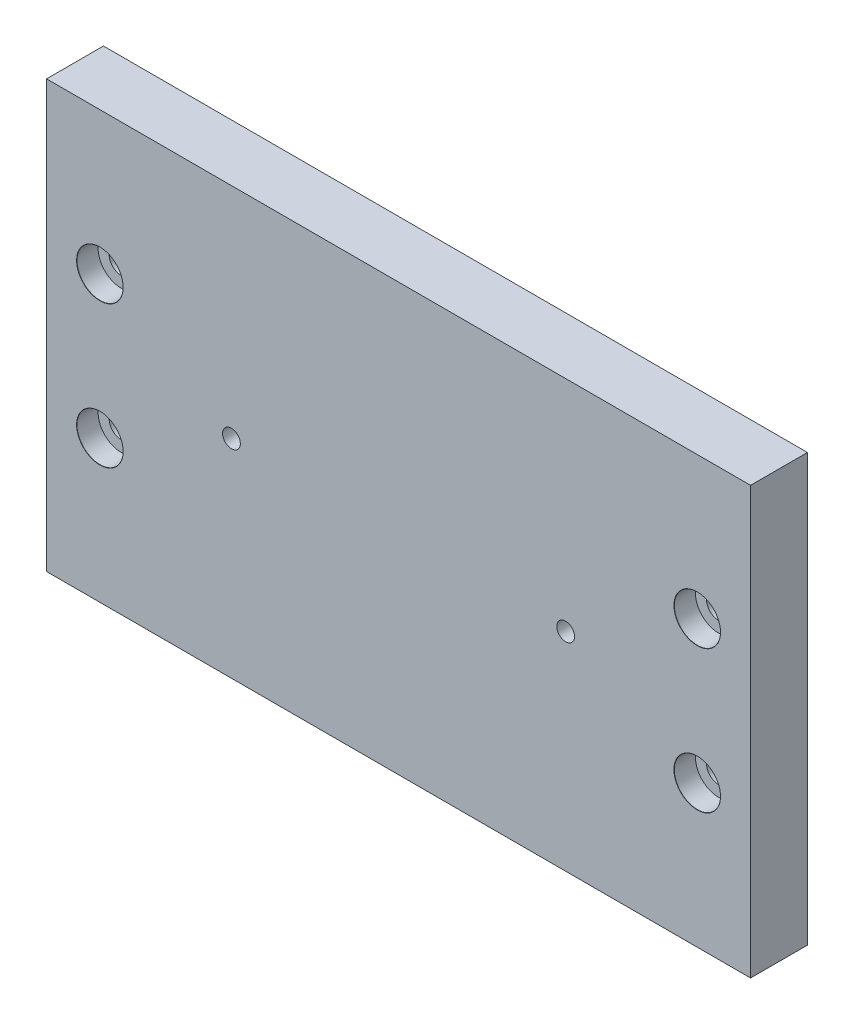
ISO-10303-21;
HEADER;
FILE_DESCRIPTION(('STEP AP214'),'2;1');
FILE_NAME('part.step','',(''),(''),'','','');
FILE_SCHEMA(('AUTOMOTIVE_DESIGN { 1 0 10303 214 1 1 1 1 }'));
ENDSEC;
DATA;
#1=APPLICATION_CONTEXT('core data for automotive mechanical design processes');
#2=APPLICATION_PROTOCOL_DEFINITION('international standard','automotive_design',2000,#1);
#3=PRODUCT_CONTEXT('',#1,'mechanical');
#4=PRODUCT('Part','Part','',(#3));
#5=PRODUCT_RELATED_PRODUCT_CATEGORY('part','',(#4));
#6=PRODUCT_DEFINITION_FORMATION('','',#4);
#7=PRODUCT_DEFINITION_CONTEXT('part definition',#1,'design');
#8=PRODUCT_DEFINITION('design','',#6,#7);
#9=PRODUCT_DEFINITION_SHAPE('','',#8);
#10=(LENGTH_UNIT() NAMED_UNIT(*) SI_UNIT(.MILLI.,.METRE.));
#11=(NAMED_UNIT(*) PLANE_ANGLE_UNIT() SI_UNIT($,.RADIAN.));
#12=(NAMED_UNIT(*) SI_UNIT($,.STERADIAN.) SOLID_ANGLE_UNIT());
#13=UNCERTAINTY_MEASURE_WITH_UNIT(LENGTH_MEASURE(1.E-05),#10,'distance_accuracy_value','');
#14=(GEOMETRIC_REPRESENTATION_CONTEXT(3) GLOBAL_UNCERTAINTY_ASSIGNED_CONTEXT((#13)) GLOBAL_UNIT_ASSIGNED_CONTEXT((#10,
#11,#12)) REPRESENTATION_CONTEXT('',''));
#15=CARTESIAN_POINT('',(0.,0.,0.));
#16=DIRECTION('',(0.,0.,1.));
#17=DIRECTION('',(1.,0.,0.));
#18=AXIS2_PLACEMENT_3D('',#15,#16,#17);
#19=CARTESIAN_POINT('',(49.5,-30.,4.));
#20=DIRECTION('',(-1.,0.,0.));
#21=DIRECTION('',(0.,0.,1.));
#22=AXIS2_PLACEMENT_3D('',#19,#20,#21);
#23=PLANE('',#22);
#24=DIRECTION('',(0.,1.,0.));
#25=VECTOR('',#24,1.);
#26=CARTESIAN_POINT('',(49.5,-30.,-4.));
#27=LINE('',#26,#25);
#28=CARTESIAN_POINT('',(49.5,-30.,-4.));
#29=VERTEX_POINT('',#28);
#30=CARTESIAN_POINT('',(49.5,30.,-4.));
#31=VERTEX_POINT('',#30);
#32=EDGE_CURVE('E100',#29,#31,#27,.T.);
#33=ORIENTED_EDGE('',*,*,#32,.T.);
#34=DIRECTION('',(0.,0.,-1.));
#35=VECTOR('',#34,1.);
#36=CARTESIAN_POINT('',(49.5,30.,4.));
#37=LINE('',#36,#35);
#38=CARTESIAN_POINT('',(49.5,30.,4.));
#39=VERTEX_POINT('',#38);
#40=EDGE_CURVE('E11',#39,#31,#37,.T.);
#41=ORIENTED_EDGE('',*,*,#40,.F.);
#42=DIRECTION('',(0.,1.,0.));
#43=VECTOR('',#42,1.);
#44=CARTESIAN_POINT('',(49.5,-30.,4.));
#45=LINE('',#44,#43);
#46=CARTESIAN_POINT('',(49.5,-30.,4.));
#47=VERTEX_POINT('',#46);
#48=EDGE_CURVE('E88',#47,#39,#45,.T.);
#49=ORIENTED_EDGE('',*,*,#48,.F.);
#50=DIRECTION('',(0.,0.,-1.));
#51=VECTOR('',#50,1.);
#52=CARTESIAN_POINT('',(49.5,-30.,4.));
#53=LINE('',#52,#51);
#54=EDGE_CURVE('E96',#47,#29,#53,.T.);
#55=ORIENTED_EDGE('',*,*,#54,.T.);
#56=EDGE_LOOP('',(#33,#41,#49,#55));
#57=FACE_BOUND('',#56,.T.);
#58=ADVANCED_FACE('F37',(#57),#23,.F.);
#59=CARTESIAN_POINT('',(-49.5,30.,4.));
#60=DIRECTION('',(0.,-1.,0.));
#61=DIRECTION('',(0.,0.,-1.));
#62=AXIS2_PLACEMENT_3D('',#59,#60,#61);
#63=PLANE('',#62);
#64=DIRECTION('',(-1.,0.,0.));
#65=VECTOR('',#64,1.);
#66=CARTESIAN_POINT('',(-49.5,30.,-4.));
#67=LINE('',#66,#65);
#68=CARTESIAN_POINT('',(-49.5,30.,-4.));
#69=VERTEX_POINT('',#68);
#70=EDGE_CURVE('E92',#31,#69,#67,.T.);
#71=ORIENTED_EDGE('',*,*,#70,.T.);
#72=DIRECTION('',(0.,0.,-1.));
#73=VECTOR('',#72,1.);
#74=CARTESIAN_POINT('',(-49.5,30.,4.));
#75=LINE('',#74,#73);
#76=CARTESIAN_POINT('',(-49.5,30.,4.));
#77=VERTEX_POINT('',#76);
#78=EDGE_CURVE('E45',#77,#69,#75,.T.);
#79=ORIENTED_EDGE('',*,*,#78,.F.);
#80=DIRECTION('',(-1.,0.,0.));
#81=VECTOR('',#80,1.);
#82=CARTESIAN_POINT('',(-49.5,30.,4.));
#83=LINE('',#82,#81);
#84=EDGE_CURVE('E83',#39,#77,#83,.T.);
#85=ORIENTED_EDGE('',*,*,#84,.F.);
#86=ORIENTED_EDGE('',*,*,#40,.T.);
#87=EDGE_LOOP('',(#71,#79,#85,#86));
#88=FACE_BOUND('',#87,.T.);
#89=ADVANCED_FACE('F91',(#88),#63,.F.);
#90=CARTESIAN_POINT('',(-49.5,-30.,4.));
#91=DIRECTION('',(1.,0.,0.));
#92=DIRECTION('',(0.,0.,-1.));
#93=AXIS2_PLACEMENT_3D('',#90,#91,#92);
#94=PLANE('',#93);
#95=DIRECTION('',(0.,-1.,0.));
#96=VECTOR('',#95,1.);
#97=CARTESIAN_POINT('',(-49.5,-30.,-4.));
#98=LINE('',#97,#96);
#99=CARTESIAN_POINT('',(-49.5,-30.,-4.));
#100=VERTEX_POINT('',#99);
#101=EDGE_CURVE('E70',#69,#100,#98,.T.);
#102=ORIENTED_EDGE('',*,*,#101,.T.);
#103=DIRECTION('',(0.,0.,-1.));
#104=VECTOR('',#103,1.);
#105=CARTESIAN_POINT('',(-49.5,-30.,4.));
#106=LINE('',#105,#104);
#107=CARTESIAN_POINT('',(-49.5,-30.,4.));
#108=VERTEX_POINT('',#107);
#109=EDGE_CURVE('E93',#108,#100,#106,.T.);
#110=ORIENTED_EDGE('',*,*,#109,.F.);
#111=DIRECTION('',(0.,-1.,0.));
#112=VECTOR('',#111,1.);
#113=CARTESIAN_POINT('',(-49.5,-30.,4.));
#114=LINE('',#113,#112);
#115=EDGE_CURVE('E86',#77,#108,#114,.T.);
#116=ORIENTED_EDGE('',*,*,#115,.F.);
#117=ORIENTED_EDGE('',*,*,#78,.T.);
#118=EDGE_LOOP('',(#102,#110,#116,#117));
#119=FACE_BOUND('',#118,.T.);
#120=ADVANCED_FACE('F94',(#119),#94,.F.);
#121=CARTESIAN_POINT('',(-49.5,-30.,4.));
#122=DIRECTION('',(0.,1.,0.));
#123=DIRECTION('',(0.,0.,1.));
#124=AXIS2_PLACEMENT_3D('',#121,#122,#123);
#125=PLANE('',#124);
#126=DIRECTION('',(1.,0.,0.));
#127=VECTOR('',#126,1.);
#128=CARTESIAN_POINT('',(-49.5,-30.,-4.));
#129=LINE('',#128,#127);
#130=EDGE_CURVE('E76',#100,#29,#129,.T.);
#131=ORIENTED_EDGE('',*,*,#130,.T.);
#132=ORIENTED_EDGE('',*,*,#54,.F.);
#133=DIRECTION('',(1.,0.,0.));
#134=VECTOR('',#133,1.);
#135=CARTESIAN_POINT('',(-49.5,-30.,4.));
#136=LINE('',#135,#134);
#137=EDGE_CURVE('E53',#108,#47,#136,.T.);
#138=ORIENTED_EDGE('',*,*,#137,.F.);
#139=ORIENTED_EDGE('',*,*,#109,.T.);
#140=EDGE_LOOP('',(#131,#132,#138,#139));
#141=FACE_BOUND('',#140,.T.);
#142=ADVANCED_FACE('F108',(#141),#125,.F.);
#143=CARTESIAN_POINT('',(0.,0.,4.));
#144=DIRECTION('',(0.,0.,-1.));
#145=DIRECTION('',(-1.,0.,0.));
#146=AXIS2_PLACEMENT_3D('',#143,#144,#145);
#147=PLANE('',#146);
#148=CARTESIAN_POINT('',(23.5,-0.800000000000002,4.));
#149=DIRECTION('',(0.,0.,1.));
#150=DIRECTION('',(1.,0.,0.));
#151=AXIS2_PLACEMENT_3D('',#148,#149,#150);
#152=CIRCLE('',#151,1.24999999999999);
#153=CARTESIAN_POINT('',(24.75,-0.800000000000002,4.));
#154=VERTEX_POINT('',#153);
#155=EDGE_CURVE('E194',#154,#154,#152,.T.);
#156=ORIENTED_EDGE('',*,*,#155,.F.);
#157=EDGE_LOOP('',(#156));
#158=FACE_BOUND('',#157,.T.);
#159=CARTESIAN_POINT('',(42.,10.,4.));
#160=DIRECTION('',(0.,0.,1.));
#161=DIRECTION('',(1.,0.,0.));
#162=AXIS2_PLACEMENT_3D('',#159,#160,#161);
#163=CIRCLE('',#162,3.275);
#164=CARTESIAN_POINT('',(45.275,10.,4.));
#165=VERTEX_POINT('',#164);
#166=EDGE_CURVE('E185',#165,#165,#163,.T.);
#167=ORIENTED_EDGE('',*,*,#166,.F.);
#168=EDGE_LOOP('',(#167));
#169=FACE_BOUND('',#168,.T.);
#170=CARTESIAN_POINT('',(42.,-10.,4.));
#171=DIRECTION('',(0.,0.,1.));
#172=DIRECTION('',(1.,0.,0.));
#173=AXIS2_PLACEMENT_3D('',#170,#171,#172);
#174=CIRCLE('',#173,3.275);
#175=CARTESIAN_POINT('',(45.275,-10.,4.));
#176=VERTEX_POINT('',#175);
#177=EDGE_CURVE('E167',#176,#176,#174,.T.);
#178=ORIENTED_EDGE('',*,*,#177,.F.);
#179=EDGE_LOOP('',(#178));
#180=FACE_BOUND('',#179,.T.);
#181=CARTESIAN_POINT('',(-23.5,-0.800000000000002,4.));
#182=DIRECTION('',(0.,0.,1.));
#183=DIRECTION('',(1.,0.,0.));
#184=AXIS2_PLACEMENT_3D('',#181,#182,#183);
#185=CIRCLE('',#184,1.24999999999999);
#186=CARTESIAN_POINT('',(-22.25,-0.800000000000002,4.));
#187=VERTEX_POINT('',#186);
#188=EDGE_CURVE('E152',#187,#187,#185,.T.);
#189=ORIENTED_EDGE('',*,*,#188,.F.);
#190=EDGE_LOOP('',(#189));
#191=FACE_BOUND('',#190,.T.);
#192=CARTESIAN_POINT('',(-42.,10.,4.));
#193=DIRECTION('',(0.,0.,1.));
#194=DIRECTION('',(1.,0.,0.));
#195=AXIS2_PLACEMENT_3D('',#192,#193,#194);
#196=CIRCLE('',#195,3.275);
#197=CARTESIAN_POINT('',(-38.725,10.,4.));
#198=VERTEX_POINT('',#197);
#199=EDGE_CURVE('E143',#198,#198,#196,.T.);
#200=ORIENTED_EDGE('',*,*,#199,.F.);
#201=EDGE_LOOP('',(#200));
#202=FACE_BOUND('',#201,.T.);
#203=CARTESIAN_POINT('',(-42.,-10.,4.));
#204=DIRECTION('',(0.,0.,1.));
#205=DIRECTION('',(1.,0.,0.));
#206=AXIS2_PLACEMENT_3D('',#203,#204,#205);
#207=CIRCLE('',#206,3.275);
#208=CARTESIAN_POINT('',(-38.725,-10.,4.));
#209=VERTEX_POINT('',#208);
#210=EDGE_CURVE('E125',#209,#209,#207,.T.);
#211=ORIENTED_EDGE('',*,*,#210,.F.);
#212=EDGE_LOOP('',(#211));
#213=FACE_BOUND('',#212,.T.);
#214=ORIENTED_EDGE('',*,*,#48,.T.);
#215=ORIENTED_EDGE('',*,*,#84,.T.);
#216=ORIENTED_EDGE('',*,*,#115,.T.);
#217=ORIENTED_EDGE('',*,*,#137,.T.);
#218=EDGE_LOOP('',(#214,#215,#216,#217));
#219=FACE_BOUND('',#218,.T.);
#220=ADVANCED_FACE('F84',(#158,#169,#180,#191,#202,#213,#219),#147,.F.);
#221=CARTESIAN_POINT('',(0.,0.,-4.));
#222=DIRECTION('',(0.,0.,-1.));
#223=DIRECTION('',(-1.,0.,0.));
#224=AXIS2_PLACEMENT_3D('',#221,#222,#223);
#225=PLANE('',#224);
#226=CARTESIAN_POINT('',(23.5,-0.800000000000002,-4.));
#227=DIRECTION('',(0.,0.,1.));
#228=DIRECTION('',(1.,0.,0.));
#229=AXIS2_PLACEMENT_3D('',#226,#227,#228);
#230=CIRCLE('',#229,1.25);
#231=CARTESIAN_POINT('',(24.75,-0.800000000000002,-4.));
#232=VERTEX_POINT('',#231);
#233=EDGE_CURVE('E191',#232,#232,#230,.T.);
#234=ORIENTED_EDGE('',*,*,#233,.T.);
#235=EDGE_LOOP('',(#234));
#236=FACE_BOUND('',#235,.T.);
#237=CARTESIAN_POINT('',(42.,10.,-4.));
#238=DIRECTION('',(0.,0.,1.));
#239=DIRECTION('',(1.,0.,0.));
#240=AXIS2_PLACEMENT_3D('',#237,#238,#239);
#241=CIRCLE('',#240,1.725);
#242=CARTESIAN_POINT('',(43.725,10.,-4.));
#243=VERTEX_POINT('',#242);
#244=EDGE_CURVE('E188',#243,#243,#241,.T.);
#245=ORIENTED_EDGE('',*,*,#244,.T.);
#246=EDGE_LOOP('',(#245));
#247=FACE_BOUND('',#246,.T.);
#248=CARTESIAN_POINT('',(42.,-10.,-4.));
#249=DIRECTION('',(0.,0.,1.));
#250=DIRECTION('',(1.,0.,0.));
#251=AXIS2_PLACEMENT_3D('',#248,#249,#250);
#252=CIRCLE('',#251,1.725);
#253=CARTESIAN_POINT('',(43.725,-10.,-4.));
#254=VERTEX_POINT('',#253);
#255=EDGE_CURVE('E170',#254,#254,#252,.T.);
#256=ORIENTED_EDGE('',*,*,#255,.T.);
#257=EDGE_LOOP('',(#256));
#258=FACE_BOUND('',#257,.T.);
#259=CARTESIAN_POINT('',(-23.5,-0.800000000000002,-4.));
#260=DIRECTION('',(0.,0.,1.));
#261=DIRECTION('',(1.,0.,0.));
#262=AXIS2_PLACEMENT_3D('',#259,#260,#261);
#263=CIRCLE('',#262,1.25);
#264=CARTESIAN_POINT('',(-22.25,-0.800000000000002,-4.));
#265=VERTEX_POINT('',#264);
#266=EDGE_CURVE('E149',#265,#265,#263,.T.);
#267=ORIENTED_EDGE('',*,*,#266,.T.);
#268=EDGE_LOOP('',(#267));
#269=FACE_BOUND('',#268,.T.);
#270=CARTESIAN_POINT('',(-42.,10.,-4.));
#271=DIRECTION('',(0.,0.,1.));
#272=DIRECTION('',(1.,0.,0.));
#273=AXIS2_PLACEMENT_3D('',#270,#271,#272);
#274=CIRCLE('',#273,1.725);
#275=CARTESIAN_POINT('',(-40.275,10.,-4.));
#276=VERTEX_POINT('',#275);
#277=EDGE_CURVE('E146',#276,#276,#274,.T.);
#278=ORIENTED_EDGE('',*,*,#277,.T.);
#279=EDGE_LOOP('',(#278));
#280=FACE_BOUND('',#279,.T.);
#281=CARTESIAN_POINT('',(-42.,-10.,-4.));
#282=DIRECTION('',(0.,0.,1.));
#283=DIRECTION('',(1.,0.,0.));
#284=AXIS2_PLACEMENT_3D('',#281,#282,#283);
#285=CIRCLE('',#284,1.725);
#286=CARTESIAN_POINT('',(-40.275,-10.,-4.));
#287=VERTEX_POINT('',#286);
#288=EDGE_CURVE('E128',#287,#287,#285,.T.);
#289=ORIENTED_EDGE('',*,*,#288,.T.);
#290=EDGE_LOOP('',(#289));
#291=FACE_BOUND('',#290,.T.);
#292=ORIENTED_EDGE('',*,*,#32,.F.);
#293=ORIENTED_EDGE('',*,*,#130,.F.);
#294=ORIENTED_EDGE('',*,*,#101,.F.);
#295=ORIENTED_EDGE('',*,*,#70,.F.);
#296=EDGE_LOOP('',(#292,#293,#294,#295));
#297=FACE_BOUND('',#296,.T.);
#298=ADVANCED_FACE('F111',(#236,#247,#258,#269,#280,#291,#297),#225,.T.);
#299=CARTESIAN_POINT('',(-42.,-10.,-3.975));
#300=DIRECTION('',(0.,0.,-1.));
#301=DIRECTION('',(-1.,0.,0.));
#302=AXIS2_PLACEMENT_3D('',#299,#300,#301);
#303=CONICAL_SURFACE('',#302,1.7,0.785398163397379);
#304=ORIENTED_EDGE('',*,*,#288,.F.);
#305=EDGE_LOOP('',(#304));
#306=FACE_BOUND('',#305,.T.);
#307=CARTESIAN_POINT('',(-42.,-10.,-3.975));
#308=DIRECTION('',(0.,0.,1.));
#309=DIRECTION('',(1.,0.,0.));
#310=AXIS2_PLACEMENT_3D('',#307,#308,#309);
#311=CIRCLE('',#310,1.7);
#312=CARTESIAN_POINT('',(-40.3,-10.,-3.975));
#313=VERTEX_POINT('',#312);
#314=EDGE_CURVE('E103',#313,#313,#311,.T.);
#315=ORIENTED_EDGE('',*,*,#314,.T.);
#316=EDGE_LOOP('',(#315));
#317=FACE_BOUND('',#316,.T.);
#318=ADVANCED_FACE('F242',(#306,#317),#303,.F.);
#319=CARTESIAN_POINT('',(-42.,-10.,4.));
#320=DIRECTION('',(0.,0.,1.));
#321=DIRECTION('',(1.,0.,0.));
#322=AXIS2_PLACEMENT_3D('',#319,#320,#321);
#323=CYLINDRICAL_SURFACE('',#322,1.7);
#324=ORIENTED_EDGE('',*,*,#314,.F.);
#325=EDGE_LOOP('',(#324));
#326=FACE_BOUND('',#325,.T.);
#327=CARTESIAN_POINT('',(-42.,-10.,1.));
#328=DIRECTION('',(0.,0.,1.));
#329=DIRECTION('',(1.,0.,0.));
#330=AXIS2_PLACEMENT_3D('',#327,#328,#329);
#331=CIRCLE('',#330,1.7);
#332=CARTESIAN_POINT('',(-40.3,-10.,1.));
#333=VERTEX_POINT('',#332);
#334=EDGE_CURVE('E116',#333,#333,#331,.T.);
#335=ORIENTED_EDGE('',*,*,#334,.T.);
#336=EDGE_LOOP('',(#335));
#337=FACE_BOUND('',#336,.T.);
#338=ADVANCED_FACE('F247',(#326,#337),#323,.F.);
#339=CARTESIAN_POINT('',(-38.75,-10.,1.));
#340=DIRECTION('',(0.,0.,-1.));
#341=DIRECTION('',(-1.,0.,0.));
#342=AXIS2_PLACEMENT_3D('',#339,#340,#341);
#343=PLANE('',#342);
#344=ORIENTED_EDGE('',*,*,#334,.F.);
#345=EDGE_LOOP('',(#344));
#346=FACE_BOUND('',#345,.T.);
#347=CARTESIAN_POINT('',(-42.,-10.,1.));
#348=DIRECTION('',(0.,0.,1.));
#349=DIRECTION('',(1.,0.,0.));
#350=AXIS2_PLACEMENT_3D('',#347,#348,#349);
#351=CIRCLE('',#350,3.25);
#352=CARTESIAN_POINT('',(-38.75,-10.,1.));
#353=VERTEX_POINT('',#352);
#354=EDGE_CURVE('E119',#353,#353,#351,.T.);
#355=ORIENTED_EDGE('',*,*,#354,.T.);
#356=EDGE_LOOP('',(#355));
#357=FACE_BOUND('',#356,.T.);
#358=ADVANCED_FACE('F226',(#346,#357),#343,.F.);
#359=CARTESIAN_POINT('',(-42.,-10.,4.));
#360=DIRECTION('',(0.,0.,1.));
#361=DIRECTION('',(1.,0.,0.));
#362=AXIS2_PLACEMENT_3D('',#359,#360,#361);
#363=CYLINDRICAL_SURFACE('',#362,3.25);
#364=ORIENTED_EDGE('',*,*,#354,.F.);
#365=EDGE_LOOP('',(#364));
#366=FACE_BOUND('',#365,.T.);
#367=CARTESIAN_POINT('',(-42.,-10.,3.975));
#368=DIRECTION('',(0.,0.,1.));
#369=DIRECTION('',(1.,0.,0.));
#370=AXIS2_PLACEMENT_3D('',#367,#368,#369);
#371=CIRCLE('',#370,3.25);
#372=CARTESIAN_POINT('',(-38.75,-10.,3.975));
#373=VERTEX_POINT('',#372);
#374=EDGE_CURVE('E122',#373,#373,#371,.T.);
#375=ORIENTED_EDGE('',*,*,#374,.T.);
#376=EDGE_LOOP('',(#375));
#377=FACE_BOUND('',#376,.T.);
#378=ADVANCED_FACE('F216',(#366,#377),#363,.F.);
#379=CARTESIAN_POINT('',(-42.,-10.,4.));
#380=DIRECTION('',(0.,0.,1.));
#381=DIRECTION('',(1.,0.,0.));
#382=AXIS2_PLACEMENT_3D('',#379,#380,#381);
#383=CONICAL_SURFACE('',#382,3.275,0.785398163397396);
#384=ORIENTED_EDGE('',*,*,#374,.F.);
#385=EDGE_LOOP('',(#384));
#386=FACE_BOUND('',#385,.T.);
#387=ORIENTED_EDGE('',*,*,#210,.T.);
#388=EDGE_LOOP('',(#387));
#389=FACE_BOUND('',#388,.T.);
#390=ADVANCED_FACE('F213',(#386,#389),#383,.F.);
#391=CARTESIAN_POINT('',(-42.,10.,-3.975));
#392=DIRECTION('',(0.,0.,-1.));
#393=DIRECTION('',(-1.,0.,0.));
#394=AXIS2_PLACEMENT_3D('',#391,#392,#393);
#395=CONICAL_SURFACE('',#394,1.7,0.785398163397379);
#396=ORIENTED_EDGE('',*,*,#277,.F.);
#397=EDGE_LOOP('',(#396));
#398=FACE_BOUND('',#397,.T.);
#399=CARTESIAN_POINT('',(-42.,10.,-3.975));
#400=DIRECTION('',(0.,0.,1.));
#401=DIRECTION('',(1.,0.,0.));
#402=AXIS2_PLACEMENT_3D('',#399,#400,#401);
#403=CIRCLE('',#402,1.7);
#404=CARTESIAN_POINT('',(-40.3,10.,-3.975));
#405=VERTEX_POINT('',#404);
#406=EDGE_CURVE('E131',#405,#405,#403,.T.);
#407=ORIENTED_EDGE('',*,*,#406,.T.);
#408=EDGE_LOOP('',(#407));
#409=FACE_BOUND('',#408,.T.);
#410=ADVANCED_FACE('F215',(#398,#409),#395,.F.);
#411=CARTESIAN_POINT('',(-42.,10.,4.));
#412=DIRECTION('',(0.,0.,1.));
#413=DIRECTION('',(1.,0.,0.));
#414=AXIS2_PLACEMENT_3D('',#411,#412,#413);
#415=CYLINDRICAL_SURFACE('',#414,1.7);
#416=ORIENTED_EDGE('',*,*,#406,.F.);
#417=EDGE_LOOP('',(#416));
#418=FACE_BOUND('',#417,.T.);
#419=CARTESIAN_POINT('',(-42.,10.,1.));
#420=DIRECTION('',(0.,0.,1.));
#421=DIRECTION('',(1.,0.,0.));
#422=AXIS2_PLACEMENT_3D('',#419,#420,#421);
#423=CIRCLE('',#422,1.7);
#424=CARTESIAN_POINT('',(-40.3,10.,1.));
#425=VERTEX_POINT('',#424);
#426=EDGE_CURVE('E134',#425,#425,#423,.T.);
#427=ORIENTED_EDGE('',*,*,#426,.T.);
#428=EDGE_LOOP('',(#427));
#429=FACE_BOUND('',#428,.T.);
#430=ADVANCED_FACE('F223',(#418,#429),#415,.F.);
#431=CARTESIAN_POINT('',(-38.75,10.,1.));
#432=DIRECTION('',(0.,0.,-1.));
#433=DIRECTION('',(-1.,0.,0.));
#434=AXIS2_PLACEMENT_3D('',#431,#432,#433);
#435=PLANE('',#434);
#436=ORIENTED_EDGE('',*,*,#426,.F.);
#437=EDGE_LOOP('',(#436));
#438=FACE_BOUND('',#437,.T.);
#439=CARTESIAN_POINT('',(-42.,10.,1.));
#440=DIRECTION('',(0.,0.,1.));
#441=DIRECTION('',(1.,0.,0.));
#442=AXIS2_PLACEMENT_3D('',#439,#440,#441);
#443=CIRCLE('',#442,3.25);
#444=CARTESIAN_POINT('',(-38.75,10.,1.));
#445=VERTEX_POINT('',#444);
#446=EDGE_CURVE('E137',#445,#445,#443,.T.);
#447=ORIENTED_EDGE('',*,*,#446,.T.);
#448=EDGE_LOOP('',(#447));
#449=FACE_BOUND('',#448,.T.);
#450=ADVANCED_FACE('F286',(#438,#449),#435,.F.);
#451=CARTESIAN_POINT('',(-42.,10.,4.));
#452=DIRECTION('',(0.,0.,1.));
#453=DIRECTION('',(1.,0.,0.));
#454=AXIS2_PLACEMENT_3D('',#451,#452,#453);
#455=CYLINDRICAL_SURFACE('',#454,3.25);
#456=ORIENTED_EDGE('',*,*,#446,.F.);
#457=EDGE_LOOP('',(#456));
#458=FACE_BOUND('',#457,.T.);
#459=CARTESIAN_POINT('',(-42.,10.,3.975));
#460=DIRECTION('',(0.,0.,1.));
#461=DIRECTION('',(1.,0.,0.));
#462=AXIS2_PLACEMENT_3D('',#459,#460,#461);
#463=CIRCLE('',#462,3.25);
#464=CARTESIAN_POINT('',(-38.75,10.,3.975));
#465=VERTEX_POINT('',#464);
#466=EDGE_CURVE('E140',#465,#465,#463,.T.);
#467=ORIENTED_EDGE('',*,*,#466,.T.);
#468=EDGE_LOOP('',(#467));
#469=FACE_BOUND('',#468,.T.);
#470=ADVANCED_FACE('F296',(#458,#469),#455,.F.);
#471=CARTESIAN_POINT('',(-42.,10.,4.));
#472=DIRECTION('',(0.,0.,1.));
#473=DIRECTION('',(1.,0.,0.));
#474=AXIS2_PLACEMENT_3D('',#471,#472,#473);
#475=CONICAL_SURFACE('',#474,3.275,0.785398163397396);
#476=ORIENTED_EDGE('',*,*,#466,.F.);
#477=EDGE_LOOP('',(#476));
#478=FACE_BOUND('',#477,.T.);
#479=ORIENTED_EDGE('',*,*,#199,.T.);
#480=EDGE_LOOP('',(#479));
#481=FACE_BOUND('',#480,.T.);
#482=ADVANCED_FACE('F306',(#478,#481),#475,.F.);
#483=CARTESIAN_POINT('',(-23.5,-0.800000000000002,4.));
#484=DIRECTION('',(0.,0.,1.));
#485=DIRECTION('',(1.,0.,0.));
#486=AXIS2_PLACEMENT_3D('',#483,#484,#485);
#487=CYLINDRICAL_SURFACE('',#486,1.24999999999999);
#488=ORIENTED_EDGE('',*,*,#266,.F.);
#489=EDGE_LOOP('',(#488));
#490=FACE_BOUND('',#489,.T.);
#491=ORIENTED_EDGE('',*,*,#188,.T.);
#492=EDGE_LOOP('',(#491));
#493=FACE_BOUND('',#492,.T.);
#494=ADVANCED_FACE('F316',(#490,#493),#487,.F.);
#495=CARTESIAN_POINT('',(42.,-10.,-3.975));
#496=DIRECTION('',(0.,0.,-1.));
#497=DIRECTION('',(-1.,0.,0.));
#498=AXIS2_PLACEMENT_3D('',#495,#496,#497);
#499=CONICAL_SURFACE('',#498,1.7,0.785398163397379);
#500=ORIENTED_EDGE('',*,*,#255,.F.);
#501=EDGE_LOOP('',(#500));
#502=FACE_BOUND('',#501,.T.);
#503=CARTESIAN_POINT('',(42.,-10.,-3.975));
#504=DIRECTION('',(0.,0.,1.));
#505=DIRECTION('',(1.,0.,0.));
#506=AXIS2_PLACEMENT_3D('',#503,#504,#505);
#507=CIRCLE('',#506,1.7);
#508=CARTESIAN_POINT('',(43.7,-10.,-3.975));
#509=VERTEX_POINT('',#508);
#510=EDGE_CURVE('E155',#509,#509,#507,.T.);
#511=ORIENTED_EDGE('',*,*,#510,.T.);
#512=EDGE_LOOP('',(#511));
#513=FACE_BOUND('',#512,.T.);
#514=ADVANCED_FACE('F327',(#502,#513),#499,.F.);
#515=CARTESIAN_POINT('',(42.,-10.,4.));
#516=DIRECTION('',(0.,0.,1.));
#517=DIRECTION('',(1.,0.,0.));
#518=AXIS2_PLACEMENT_3D('',#515,#516,#517);
#519=CYLINDRICAL_SURFACE('',#518,1.7);
#520=ORIENTED_EDGE('',*,*,#510,.F.);
#521=EDGE_LOOP('',(#520));
#522=FACE_BOUND('',#521,.T.);
#523=CARTESIAN_POINT('',(42.,-10.,1.));
#524=DIRECTION('',(0.,0.,1.));
#525=DIRECTION('',(1.,0.,0.));
#526=AXIS2_PLACEMENT_3D('',#523,#524,#525);
#527=CIRCLE('',#526,1.7);
#528=CARTESIAN_POINT('',(43.7,-10.,1.));
#529=VERTEX_POINT('',#528);
#530=EDGE_CURVE('E158',#529,#529,#527,.T.);
#531=ORIENTED_EDGE('',*,*,#530,.T.);
#532=EDGE_LOOP('',(#531));
#533=FACE_BOUND('',#532,.T.);
#534=ADVANCED_FACE('F354',(#522,#533),#519,.F.);
#535=CARTESIAN_POINT('',(45.25,-10.,1.));
#536=DIRECTION('',(0.,0.,-1.));
#537=DIRECTION('',(-1.,0.,0.));
#538=AXIS2_PLACEMENT_3D('',#535,#536,#537);
#539=PLANE('',#538);
#540=ORIENTED_EDGE('',*,*,#530,.F.);
#541=EDGE_LOOP('',(#540));
#542=FACE_BOUND('',#541,.T.);
#543=CARTESIAN_POINT('',(42.,-10.,1.));
#544=DIRECTION('',(0.,0.,1.));
#545=DIRECTION('',(1.,0.,0.));
#546=AXIS2_PLACEMENT_3D('',#543,#544,#545);
#547=CIRCLE('',#546,3.25);
#548=CARTESIAN_POINT('',(45.25,-10.,1.));
#549=VERTEX_POINT('',#548);
#550=EDGE_CURVE('E161',#549,#549,#547,.T.);
#551=ORIENTED_EDGE('',*,*,#550,.T.);
#552=EDGE_LOOP('',(#551));
#553=FACE_BOUND('',#552,.T.);
#554=ADVANCED_FACE('F364',(#542,#553),#539,.F.);
#555=CARTESIAN_POINT('',(42.,-10.,4.));
#556=DIRECTION('',(0.,0.,1.));
#557=DIRECTION('',(1.,0.,0.));
#558=AXIS2_PLACEMENT_3D('',#555,#556,#557);
#559=CYLINDRICAL_SURFACE('',#558,3.25);
#560=ORIENTED_EDGE('',*,*,#550,.F.);
#561=EDGE_LOOP('',(#560));
#562=FACE_BOUND('',#561,.T.);
#563=CARTESIAN_POINT('',(42.,-10.,3.975));
#564=DIRECTION('',(0.,0.,1.));
#565=DIRECTION('',(1.,0.,0.));
#566=AXIS2_PLACEMENT_3D('',#563,#564,#565);
#567=CIRCLE('',#566,3.25);
#568=CARTESIAN_POINT('',(45.25,-10.,3.975));
#569=VERTEX_POINT('',#568);
#570=EDGE_CURVE('E164',#569,#569,#567,.T.);
#571=ORIENTED_EDGE('',*,*,#570,.T.);
#572=EDGE_LOOP('',(#571));
#573=FACE_BOUND('',#572,.T.);
#574=ADVANCED_FACE('F374',(#562,#573),#559,.F.);
#575=CARTESIAN_POINT('',(42.,-10.,4.));
#576=DIRECTION('',(0.,0.,1.));
#577=DIRECTION('',(1.,0.,0.));
#578=AXIS2_PLACEMENT_3D('',#575,#576,#577);
#579=CONICAL_SURFACE('',#578,3.275,0.785398163397396);
#580=ORIENTED_EDGE('',*,*,#570,.F.);
#581=EDGE_LOOP('',(#580));
#582=FACE_BOUND('',#581,.T.);
#583=ORIENTED_EDGE('',*,*,#177,.T.);
#584=EDGE_LOOP('',(#583));
#585=FACE_BOUND('',#584,.T.);
#586=ADVANCED_FACE('F384',(#582,#585),#579,.F.);
#587=CARTESIAN_POINT('',(42.,10.,-3.975));
#588=DIRECTION('',(0.,0.,-1.));
#589=DIRECTION('',(-1.,0.,0.));
#590=AXIS2_PLACEMENT_3D('',#587,#588,#589);
#591=CONICAL_SURFACE('',#590,1.7,0.785398163397379);
#592=ORIENTED_EDGE('',*,*,#244,.F.);
#593=EDGE_LOOP('',(#592));
#594=FACE_BOUND('',#593,.T.);
#595=CARTESIAN_POINT('',(42.,10.,-3.975));
#596=DIRECTION('',(0.,0.,1.));
#597=DIRECTION('',(1.,0.,0.));
#598=AXIS2_PLACEMENT_3D('',#595,#596,#597);
#599=CIRCLE('',#598,1.7);
#600=CARTESIAN_POINT('',(43.7,10.,-3.975));
#601=VERTEX_POINT('',#600);
#602=EDGE_CURVE('E173',#601,#601,#599,.T.);
#603=ORIENTED_EDGE('',*,*,#602,.T.);
#604=EDGE_LOOP('',(#603));
#605=FACE_BOUND('',#604,.T.);
#606=ADVANCED_FACE('F394',(#594,#605),#591,.F.);
#607=CARTESIAN_POINT('',(42.,10.,4.));
#608=DIRECTION('',(0.,0.,1.));
#609=DIRECTION('',(1.,0.,0.));
#610=AXIS2_PLACEMENT_3D('',#607,#608,#609);
#611=CYLINDRICAL_SURFACE('',#610,1.7);
#612=ORIENTED_EDGE('',*,*,#602,.F.);
#613=EDGE_LOOP('',(#612));
#614=FACE_BOUND('',#613,.T.);
#615=CARTESIAN_POINT('',(42.,10.,1.));
#616=DIRECTION('',(0.,0.,1.));
#617=DIRECTION('',(1.,0.,0.));
#618=AXIS2_PLACEMENT_3D('',#615,#616,#617);
#619=CIRCLE('',#618,1.7);
#620=CARTESIAN_POINT('',(43.7,10.,1.));
#621=VERTEX_POINT('',#620);
#622=EDGE_CURVE('E176',#621,#621,#619,.T.);
#623=ORIENTED_EDGE('',*,*,#622,.T.);
#624=EDGE_LOOP('',(#623));
#625=FACE_BOUND('',#624,.T.);
#626=ADVANCED_FACE('F404',(#614,#625),#611,.F.);
#627=CARTESIAN_POINT('',(45.25,10.,1.));
#628=DIRECTION('',(0.,0.,-1.));
#629=DIRECTION('',(-1.,0.,0.));
#630=AXIS2_PLACEMENT_3D('',#627,#628,#629);
#631=PLANE('',#630);
#632=ORIENTED_EDGE('',*,*,#622,.F.);
#633=EDGE_LOOP('',(#632));
#634=FACE_BOUND('',#633,.T.);
#635=CARTESIAN_POINT('',(42.,10.,1.));
#636=DIRECTION('',(0.,0.,1.));
#637=DIRECTION('',(1.,0.,0.));
#638=AXIS2_PLACEMENT_3D('',#635,#636,#637);
#639=CIRCLE('',#638,3.25);
#640=CARTESIAN_POINT('',(45.25,10.,1.));
#641=VERTEX_POINT('',#640);
#642=EDGE_CURVE('E179',#641,#641,#639,.T.);
#643=ORIENTED_EDGE('',*,*,#642,.T.);
#644=EDGE_LOOP('',(#643));
#645=FACE_BOUND('',#644,.T.);
#646=ADVANCED_FACE('F414',(#634,#645),#631,.F.);
#647=CARTESIAN_POINT('',(42.,10.,4.));
#648=DIRECTION('',(0.,0.,1.));
#649=DIRECTION('',(1.,0.,0.));
#650=AXIS2_PLACEMENT_3D('',#647,#648,#649);
#651=CYLINDRICAL_SURFACE('',#650,3.25);
#652=ORIENTED_EDGE('',*,*,#642,.F.);
#653=EDGE_LOOP('',(#652));
#654=FACE_BOUND('',#653,.T.);
#655=CARTESIAN_POINT('',(42.,10.,3.975));
#656=DIRECTION('',(0.,0.,1.));
#657=DIRECTION('',(1.,0.,0.));
#658=AXIS2_PLACEMENT_3D('',#655,#656,#657);
#659=CIRCLE('',#658,3.25);
#660=CARTESIAN_POINT('',(45.25,10.,3.975));
#661=VERTEX_POINT('',#660);
#662=EDGE_CURVE('E182',#661,#661,#659,.T.);
#663=ORIENTED_EDGE('',*,*,#662,.T.);
#664=EDGE_LOOP('',(#663));
#665=FACE_BOUND('',#664,.T.);
#666=ADVANCED_FACE('F424',(#654,#665),#651,.F.);
#667=CARTESIAN_POINT('',(42.,10.,4.));
#668=DIRECTION('',(0.,0.,1.));
#669=DIRECTION('',(1.,0.,0.));
#670=AXIS2_PLACEMENT_3D('',#667,#668,#669);
#671=CONICAL_SURFACE('',#670,3.275,0.785398163397396);
#672=ORIENTED_EDGE('',*,*,#662,.F.);
#673=EDGE_LOOP('',(#672));
#674=FACE_BOUND('',#673,.T.);
#675=ORIENTED_EDGE('',*,*,#166,.T.);
#676=EDGE_LOOP('',(#675));
#677=FACE_BOUND('',#676,.T.);
#678=ADVANCED_FACE('F434',(#674,#677),#671,.F.);
#679=CARTESIAN_POINT('',(23.5,-0.800000000000002,4.));
#680=DIRECTION('',(0.,0.,1.));
#681=DIRECTION('',(1.,0.,0.));
#682=AXIS2_PLACEMENT_3D('',#679,#680,#681);
#683=CYLINDRICAL_SURFACE('',#682,1.24999999999999);
#684=ORIENTED_EDGE('',*,*,#233,.F.);
#685=EDGE_LOOP('',(#684));
#686=FACE_BOUND('',#685,.T.);
#687=ORIENTED_EDGE('',*,*,#155,.T.);
#688=EDGE_LOOP('',(#687));
#689=FACE_BOUND('',#688,.T.);
#690=ADVANCED_FACE('F198',(#686,#689),#683,.F.);
#691=CLOSED_SHELL('',(#58,#89,#120,#142,#220,#298,#318,#338,#358,#378,#390,#410,#430,#450,#470,
#482,#494,#514,#534,#554,#574,#586,#606,#626,#646,#666,#678,#690));
#692=MANIFOLD_SOLID_BREP('B2',#691);
#693=ADVANCED_BREP_SHAPE_REPRESENTATION('',(#18,#692),#14);
#694=SHAPE_DEFINITION_REPRESENTATION(#9,#693);
ENDSEC;
END-ISO-10303-21;
